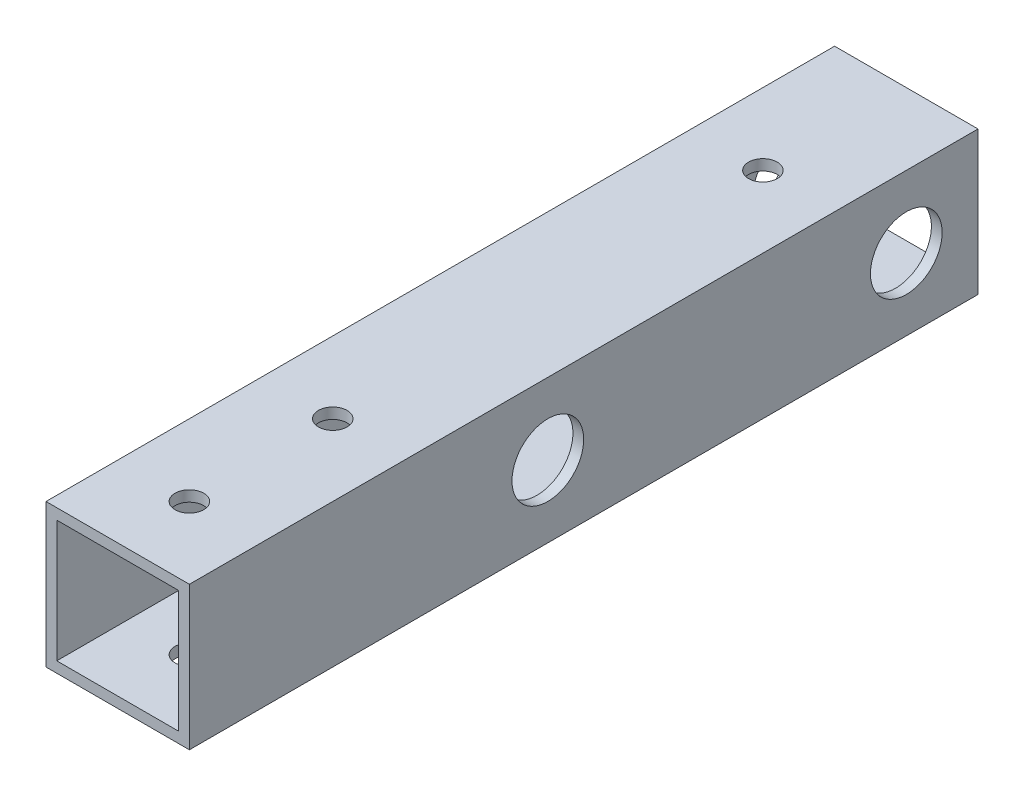
ISO-10303-21;
HEADER;
FILE_DESCRIPTION(('STEP AP214'),'2;1');
FILE_NAME('part.step','',(''),(''),'','','');
FILE_SCHEMA(('AUTOMOTIVE_DESIGN { 1 0 10303 214 1 1 1 1 }'));
ENDSEC;
DATA;
#1=APPLICATION_CONTEXT('core data for automotive mechanical design processes');
#2=APPLICATION_PROTOCOL_DEFINITION('international standard','automotive_design',2000,#1);
#3=PRODUCT_CONTEXT('',#1,'mechanical');
#4=PRODUCT('Part','Part','',(#3));
#5=PRODUCT_RELATED_PRODUCT_CATEGORY('part','',(#4));
#6=PRODUCT_DEFINITION_FORMATION('','',#4);
#7=PRODUCT_DEFINITION_CONTEXT('part definition',#1,'design');
#8=PRODUCT_DEFINITION('design','',#6,#7);
#9=PRODUCT_DEFINITION_SHAPE('','',#8);
#10=(LENGTH_UNIT() NAMED_UNIT(*) SI_UNIT(.MILLI.,.METRE.));
#11=(NAMED_UNIT(*) PLANE_ANGLE_UNIT() SI_UNIT($,.RADIAN.));
#12=(NAMED_UNIT(*) SI_UNIT($,.STERADIAN.) SOLID_ANGLE_UNIT());
#13=UNCERTAINTY_MEASURE_WITH_UNIT(LENGTH_MEASURE(1.E-05),#10,'distance_accuracy_value','');
#14=(GEOMETRIC_REPRESENTATION_CONTEXT(3) GLOBAL_UNCERTAINTY_ASSIGNED_CONTEXT((#13)) GLOBAL_UNIT_ASSIGNED_CONTEXT((#10,
#11,#12)) REPRESENTATION_CONTEXT('',''));
#15=CARTESIAN_POINT('',(0.,0.,0.));
#16=DIRECTION('',(0.,0.,1.));
#17=DIRECTION('',(1.,0.,0.));
#18=AXIS2_PLACEMENT_3D('',#15,#16,#17);
#19=CARTESIAN_POINT('',(0.,0.,110.));
#20=DIRECTION('',(0.,0.,-1.));
#21=DIRECTION('',(-1.,0.,0.));
#22=AXIS2_PLACEMENT_3D('',#19,#20,#21);
#23=PLANE('',#22);
#24=DIRECTION('',(0.,1.,0.));
#25=VECTOR('',#24,1.);
#26=CARTESIAN_POINT('',(10.,-10.,110.));
#27=LINE('',#26,#25);
#28=CARTESIAN_POINT('',(10.,-10.,110.));
#29=VERTEX_POINT('',#28);
#30=CARTESIAN_POINT('',(10.,10.,110.));
#31=VERTEX_POINT('',#30);
#32=EDGE_CURVE('E146',#29,#31,#27,.T.);
#33=ORIENTED_EDGE('',*,*,#32,.T.);
#34=DIRECTION('',(-1.,0.,0.));
#35=VECTOR('',#34,1.);
#36=CARTESIAN_POINT('',(-10.,10.,110.));
#37=LINE('',#36,#35);
#38=CARTESIAN_POINT('',(-10.,10.,110.));
#39=VERTEX_POINT('',#38);
#40=EDGE_CURVE('E149',#31,#39,#37,.T.);
#41=ORIENTED_EDGE('',*,*,#40,.T.);
#42=DIRECTION('',(0.,-1.,0.));
#43=VECTOR('',#42,1.);
#44=CARTESIAN_POINT('',(-10.,-10.,110.));
#45=LINE('',#44,#43);
#46=CARTESIAN_POINT('',(-10.,-10.,110.));
#47=VERTEX_POINT('',#46);
#48=EDGE_CURVE('E152',#39,#47,#45,.T.);
#49=ORIENTED_EDGE('',*,*,#48,.T.);
#50=DIRECTION('',(1.,0.,0.));
#51=VECTOR('',#50,1.);
#52=CARTESIAN_POINT('',(-10.,-10.,110.));
#53=LINE('',#52,#51);
#54=EDGE_CURVE('E154',#47,#29,#53,.T.);
#55=ORIENTED_EDGE('',*,*,#54,.T.);
#56=EDGE_LOOP('',(#33,#41,#49,#55));
#57=FACE_BOUND('',#56,.T.);
#58=DIRECTION('',(0.,1.,0.));
#59=VECTOR('',#58,1.);
#60=CARTESIAN_POINT('',(8.5,-8.5,110.));
#61=LINE('',#60,#59);
#62=CARTESIAN_POINT('',(8.5,-8.5,110.));
#63=VERTEX_POINT('',#62);
#64=CARTESIAN_POINT('',(8.5,8.5,110.));
#65=VERTEX_POINT('',#64);
#66=EDGE_CURVE('E108',#63,#65,#61,.T.);
#67=ORIENTED_EDGE('',*,*,#66,.F.);
#68=DIRECTION('',(1.,0.,0.));
#69=VECTOR('',#68,1.);
#70=CARTESIAN_POINT('',(-8.5,-8.5,110.));
#71=LINE('',#70,#69);
#72=CARTESIAN_POINT('',(-8.5,-8.5,110.));
#73=VERTEX_POINT('',#72);
#74=EDGE_CURVE('E130',#73,#63,#71,.T.);
#75=ORIENTED_EDGE('',*,*,#74,.F.);
#76=DIRECTION('',(0.,-1.,0.));
#77=VECTOR('',#76,1.);
#78=CARTESIAN_POINT('',(-8.5,-8.5,110.));
#79=LINE('',#78,#77);
#80=CARTESIAN_POINT('',(-8.5,8.5,110.));
#81=VERTEX_POINT('',#80);
#82=EDGE_CURVE('E128',#81,#73,#79,.T.);
#83=ORIENTED_EDGE('',*,*,#82,.F.);
#84=DIRECTION('',(-1.,0.,0.));
#85=VECTOR('',#84,1.);
#86=CARTESIAN_POINT('',(-8.5,8.5,110.));
#87=LINE('',#86,#85);
#88=EDGE_CURVE('E116',#65,#81,#87,.T.);
#89=ORIENTED_EDGE('',*,*,#88,.F.);
#90=EDGE_LOOP('',(#67,#75,#83,#89));
#91=FACE_BOUND('',#90,.T.);
#92=ADVANCED_FACE('F41',(#57,#91),#23,.F.);
#93=CARTESIAN_POINT('',(0.,0.,0.));
#94=DIRECTION('',(0.,0.,-1.));
#95=DIRECTION('',(-1.,0.,0.));
#96=AXIS2_PLACEMENT_3D('',#93,#94,#95);
#97=PLANE('',#96);
#98=DIRECTION('',(0.,1.,0.));
#99=VECTOR('',#98,1.);
#100=CARTESIAN_POINT('',(10.,-10.,0.));
#101=LINE('',#100,#99);
#102=CARTESIAN_POINT('',(10.,-10.,0.));
#103=VERTEX_POINT('',#102);
#104=CARTESIAN_POINT('',(10.,10.,0.));
#105=VERTEX_POINT('',#104);
#106=EDGE_CURVE('E124',#103,#105,#101,.T.);
#107=ORIENTED_EDGE('',*,*,#106,.F.);
#108=DIRECTION('',(1.,0.,0.));
#109=VECTOR('',#108,1.);
#110=CARTESIAN_POINT('',(-10.,-10.,0.));
#111=LINE('',#110,#109);
#112=CARTESIAN_POINT('',(-10.,-10.,0.));
#113=VERTEX_POINT('',#112);
#114=EDGE_CURVE('E150',#113,#103,#111,.T.);
#115=ORIENTED_EDGE('',*,*,#114,.F.);
#116=DIRECTION('',(0.,-1.,0.));
#117=VECTOR('',#116,1.);
#118=CARTESIAN_POINT('',(-10.,-10.,0.));
#119=LINE('',#118,#117);
#120=CARTESIAN_POINT('',(-10.,10.,0.));
#121=VERTEX_POINT('',#120);
#122=EDGE_CURVE('E161',#121,#113,#119,.T.);
#123=ORIENTED_EDGE('',*,*,#122,.F.);
#124=DIRECTION('',(-1.,0.,0.));
#125=VECTOR('',#124,1.);
#126=CARTESIAN_POINT('',(-10.,10.,0.));
#127=LINE('',#126,#125);
#128=EDGE_CURVE('E159',#105,#121,#127,.T.);
#129=ORIENTED_EDGE('',*,*,#128,.F.);
#130=EDGE_LOOP('',(#107,#115,#123,#129));
#131=FACE_BOUND('',#130,.T.);
#132=DIRECTION('',(1.,0.,0.));
#133=VECTOR('',#132,1.);
#134=CARTESIAN_POINT('',(-8.5,-8.5,0.));
#135=LINE('',#134,#133);
#136=CARTESIAN_POINT('',(-8.5,-8.5,0.));
#137=VERTEX_POINT('',#136);
#138=CARTESIAN_POINT('',(8.5,-8.5,0.));
#139=VERTEX_POINT('',#138);
#140=EDGE_CURVE('E117',#137,#139,#135,.T.);
#141=ORIENTED_EDGE('',*,*,#140,.T.);
#142=DIRECTION('',(0.,1.,0.));
#143=VECTOR('',#142,1.);
#144=CARTESIAN_POINT('',(8.5,-8.5,0.));
#145=LINE('',#144,#143);
#146=CARTESIAN_POINT('',(8.5,8.5,0.));
#147=VERTEX_POINT('',#146);
#148=EDGE_CURVE('E66',#139,#147,#145,.T.);
#149=ORIENTED_EDGE('',*,*,#148,.T.);
#150=DIRECTION('',(-1.,0.,0.));
#151=VECTOR('',#150,1.);
#152=CARTESIAN_POINT('',(-8.5,8.5,0.));
#153=LINE('',#152,#151);
#154=CARTESIAN_POINT('',(-8.5,8.5,0.));
#155=VERTEX_POINT('',#154);
#156=EDGE_CURVE('E123',#147,#155,#153,.T.);
#157=ORIENTED_EDGE('',*,*,#156,.T.);
#158=DIRECTION('',(0.,-1.,0.));
#159=VECTOR('',#158,1.);
#160=CARTESIAN_POINT('',(-8.5,-8.5,0.));
#161=LINE('',#160,#159);
#162=EDGE_CURVE('E138',#155,#137,#161,.T.);
#163=ORIENTED_EDGE('',*,*,#162,.T.);
#164=EDGE_LOOP('',(#141,#149,#157,#163));
#165=FACE_BOUND('',#164,.T.);
#166=ADVANCED_FACE('F254',(#131,#165),#97,.T.);
#167=CARTESIAN_POINT('',(10.,-10.,110.));
#168=DIRECTION('',(-1.,0.,0.));
#169=DIRECTION('',(0.,0.,1.));
#170=AXIS2_PLACEMENT_3D('',#167,#168,#169);
#171=PLANE('',#170);
#172=CARTESIAN_POINT('',(10.,0.,10.));
#173=DIRECTION('',(-1.,0.,0.));
#174=DIRECTION('',(0.,0.,1.));
#175=AXIS2_PLACEMENT_3D('',#172,#173,#174);
#176=CIRCLE('',#175,5.);
#177=CARTESIAN_POINT('',(10.,0.,15.));
#178=VERTEX_POINT('',#177);
#179=EDGE_CURVE('E193',#178,#178,#176,.T.);
#180=ORIENTED_EDGE('',*,*,#179,.T.);
#181=EDGE_LOOP('',(#180));
#182=FACE_BOUND('',#181,.T.);
#183=CARTESIAN_POINT('',(10.,0.,60.));
#184=DIRECTION('',(-1.,0.,0.));
#185=DIRECTION('',(0.,0.,1.));
#186=AXIS2_PLACEMENT_3D('',#183,#184,#185);
#187=CIRCLE('',#186,5.);
#188=CARTESIAN_POINT('',(10.,0.,65.));
#189=VERTEX_POINT('',#188);
#190=EDGE_CURVE('E198',#189,#189,#187,.T.);
#191=ORIENTED_EDGE('',*,*,#190,.T.);
#192=EDGE_LOOP('',(#191));
#193=FACE_BOUND('',#192,.T.);
#194=ORIENTED_EDGE('',*,*,#106,.T.);
#195=DIRECTION('',(0.,0.,-1.));
#196=VECTOR('',#195,1.);
#197=CARTESIAN_POINT('',(10.,10.,110.));
#198=LINE('',#197,#196);
#199=EDGE_CURVE('E11',#31,#105,#198,.T.);
#200=ORIENTED_EDGE('',*,*,#199,.F.);
#201=ORIENTED_EDGE('',*,*,#32,.F.);
#202=DIRECTION('',(0.,0.,-1.));
#203=VECTOR('',#202,1.);
#204=CARTESIAN_POINT('',(10.,-10.,110.));
#205=LINE('',#204,#203);
#206=EDGE_CURVE('E156',#29,#103,#205,.T.);
#207=ORIENTED_EDGE('',*,*,#206,.T.);
#208=EDGE_LOOP('',(#194,#200,#201,#207));
#209=FACE_BOUND('',#208,.T.);
#210=ADVANCED_FACE('F43',(#182,#193,#209),#171,.F.);
#211=CARTESIAN_POINT('',(-10.,10.,110.));
#212=DIRECTION('',(0.,-1.,0.));
#213=DIRECTION('',(0.,0.,-1.));
#214=AXIS2_PLACEMENT_3D('',#211,#212,#213);
#215=PLANE('',#214);
#216=CARTESIAN_POINT('',(0.,10.,100.));
#217=DIRECTION('',(0.,1.,0.));
#218=DIRECTION('',(0.,0.,1.));
#219=AXIS2_PLACEMENT_3D('',#216,#217,#218);
#220=CIRCLE('',#219,2.);
#221=CARTESIAN_POINT('',(0.,10.,102.));
#222=VERTEX_POINT('',#221);
#223=EDGE_CURVE('E210',#222,#222,#220,.T.);
#224=ORIENTED_EDGE('',*,*,#223,.F.);
#225=EDGE_LOOP('',(#224));
#226=FACE_BOUND('',#225,.T.);
#227=CARTESIAN_POINT('',(0.,10.,80.));
#228=DIRECTION('',(0.,1.,0.));
#229=DIRECTION('',(0.,0.,1.));
#230=AXIS2_PLACEMENT_3D('',#227,#228,#229);
#231=CIRCLE('',#230,2.);
#232=CARTESIAN_POINT('',(0.,10.,82.));
#233=VERTEX_POINT('',#232);
#234=EDGE_CURVE('E213',#233,#233,#231,.T.);
#235=ORIENTED_EDGE('',*,*,#234,.F.);
#236=EDGE_LOOP('',(#235));
#237=FACE_BOUND('',#236,.T.);
#238=CARTESIAN_POINT('',(-2.06718869533235E-13,10.,20.));
#239=DIRECTION('',(0.,1.,0.));
#240=DIRECTION('',(0.,0.,1.));
#241=AXIS2_PLACEMENT_3D('',#238,#239,#240);
#242=CIRCLE('',#241,2.);
#243=CARTESIAN_POINT('',(-2.06718869533235E-13,10.,22.));
#244=VERTEX_POINT('',#243);
#245=EDGE_CURVE('E189',#244,#244,#242,.T.);
#246=ORIENTED_EDGE('',*,*,#245,.F.);
#247=EDGE_LOOP('',(#246));
#248=FACE_BOUND('',#247,.T.);
#249=ORIENTED_EDGE('',*,*,#128,.T.);
#250=DIRECTION('',(0.,0.,-1.));
#251=VECTOR('',#250,1.);
#252=CARTESIAN_POINT('',(-10.,10.,110.));
#253=LINE('',#252,#251);
#254=EDGE_CURVE('E50',#39,#121,#253,.T.);
#255=ORIENTED_EDGE('',*,*,#254,.F.);
#256=ORIENTED_EDGE('',*,*,#40,.F.);
#257=ORIENTED_EDGE('',*,*,#199,.T.);
#258=EDGE_LOOP('',(#249,#255,#256,#257));
#259=FACE_BOUND('',#258,.T.);
#260=ADVANCED_FACE('F270',(#226,#237,#248,#259),#215,.F.);
#261=CARTESIAN_POINT('',(-10.,-10.,110.));
#262=DIRECTION('',(1.,0.,0.));
#263=DIRECTION('',(0.,0.,-1.));
#264=AXIS2_PLACEMENT_3D('',#261,#262,#263);
#265=PLANE('',#264);
#266=CARTESIAN_POINT('',(-10.,0.,10.));
#267=DIRECTION('',(1.,0.,0.));
#268=DIRECTION('',(0.,0.,-1.));
#269=AXIS2_PLACEMENT_3D('',#266,#267,#268);
#270=CIRCLE('',#269,2.7);
#271=CARTESIAN_POINT('',(-10.,0.,7.3));
#272=VERTEX_POINT('',#271);
#273=EDGE_CURVE('E136',#272,#272,#270,.T.);
#274=ORIENTED_EDGE('',*,*,#273,.T.);
#275=EDGE_LOOP('',(#274));
#276=FACE_BOUND('',#275,.T.);
#277=CARTESIAN_POINT('',(-10.,0.,60.));
#278=DIRECTION('',(1.,0.,0.));
#279=DIRECTION('',(0.,0.,-1.));
#280=AXIS2_PLACEMENT_3D('',#277,#278,#279);
#281=CIRCLE('',#280,2.7);
#282=CARTESIAN_POINT('',(-10.,0.,57.3));
#283=VERTEX_POINT('',#282);
#284=EDGE_CURVE('E174',#283,#283,#281,.T.);
#285=ORIENTED_EDGE('',*,*,#284,.T.);
#286=EDGE_LOOP('',(#285));
#287=FACE_BOUND('',#286,.T.);
#288=ORIENTED_EDGE('',*,*,#122,.T.);
#289=DIRECTION('',(0.,0.,-1.));
#290=VECTOR('',#289,1.);
#291=CARTESIAN_POINT('',(-10.,-10.,110.));
#292=LINE('',#291,#290);
#293=EDGE_CURVE('E166',#47,#113,#292,.T.);
#294=ORIENTED_EDGE('',*,*,#293,.F.);
#295=ORIENTED_EDGE('',*,*,#48,.F.);
#296=ORIENTED_EDGE('',*,*,#254,.T.);
#297=EDGE_LOOP('',(#288,#294,#295,#296));
#298=FACE_BOUND('',#297,.T.);
#299=ADVANCED_FACE('F231',(#276,#287,#298),#265,.F.);
#300=CARTESIAN_POINT('',(-10.,-10.,110.));
#301=DIRECTION('',(0.,1.,0.));
#302=DIRECTION('',(0.,0.,1.));
#303=AXIS2_PLACEMENT_3D('',#300,#301,#302);
#304=PLANE('',#303);
#305=CARTESIAN_POINT('',(-5.38458166943201E-12,-10.,20.0000000000006));
#306=DIRECTION('',(0.,-1.,0.));
#307=DIRECTION('',(0.,0.,-1.));
#308=AXIS2_PLACEMENT_3D('',#305,#306,#307);
#309=CIRCLE('',#308,5.);
#310=CARTESIAN_POINT('',(-5.38458166943201E-12,-10.,15.0000000000006));
#311=VERTEX_POINT('',#310);
#312=EDGE_CURVE('E190',#311,#311,#309,.T.);
#313=ORIENTED_EDGE('',*,*,#312,.F.);
#314=EDGE_LOOP('',(#313));
#315=FACE_BOUND('',#314,.T.);
#316=CARTESIAN_POINT('',(0.,-10.,100.));
#317=DIRECTION('',(0.,1.,0.));
#318=DIRECTION('',(0.,0.,1.));
#319=AXIS2_PLACEMENT_3D('',#316,#317,#318);
#320=CIRCLE('',#319,2.);
#321=CARTESIAN_POINT('',(0.,-10.,102.));
#322=VERTEX_POINT('',#321);
#323=EDGE_CURVE('E207',#322,#322,#320,.T.);
#324=ORIENTED_EDGE('',*,*,#323,.T.);
#325=EDGE_LOOP('',(#324));
#326=FACE_BOUND('',#325,.T.);
#327=CARTESIAN_POINT('',(0.,-10.,80.));
#328=DIRECTION('',(0.,1.,0.));
#329=DIRECTION('',(0.,0.,1.));
#330=AXIS2_PLACEMENT_3D('',#327,#328,#329);
#331=CIRCLE('',#330,2.);
#332=CARTESIAN_POINT('',(0.,-10.,82.));
#333=VERTEX_POINT('',#332);
#334=EDGE_CURVE('E216',#333,#333,#331,.T.);
#335=ORIENTED_EDGE('',*,*,#334,.T.);
#336=EDGE_LOOP('',(#335));
#337=FACE_BOUND('',#336,.T.);
#338=ORIENTED_EDGE('',*,*,#114,.T.);
#339=ORIENTED_EDGE('',*,*,#206,.F.);
#340=ORIENTED_EDGE('',*,*,#54,.F.);
#341=ORIENTED_EDGE('',*,*,#293,.T.);
#342=EDGE_LOOP('',(#338,#339,#340,#341));
#343=FACE_BOUND('',#342,.T.);
#344=ADVANCED_FACE('F265',(#315,#326,#337,#343),#304,.F.);
#345=CARTESIAN_POINT('',(8.5,-8.5,110.));
#346=DIRECTION('',(-1.,0.,0.));
#347=DIRECTION('',(0.,0.,1.));
#348=AXIS2_PLACEMENT_3D('',#345,#346,#347);
#349=PLANE('',#348);
#350=CARTESIAN_POINT('',(8.5,0.,10.));
#351=DIRECTION('',(-1.,0.,0.));
#352=DIRECTION('',(0.,0.,1.));
#353=AXIS2_PLACEMENT_3D('',#350,#351,#352);
#354=CIRCLE('',#353,5.);
#355=CARTESIAN_POINT('',(8.5,0.,15.));
#356=VERTEX_POINT('',#355);
#357=EDGE_CURVE('E45',#356,#356,#354,.T.);
#358=ORIENTED_EDGE('',*,*,#357,.F.);
#359=EDGE_LOOP('',(#358));
#360=FACE_BOUND('',#359,.T.);
#361=CARTESIAN_POINT('',(8.5,0.,60.));
#362=DIRECTION('',(-1.,0.,0.));
#363=DIRECTION('',(0.,0.,1.));
#364=AXIS2_PLACEMENT_3D('',#361,#362,#363);
#365=CIRCLE('',#364,5.);
#366=CARTESIAN_POINT('',(8.5,0.,65.));
#367=VERTEX_POINT('',#366);
#368=EDGE_CURVE('E191',#367,#367,#365,.T.);
#369=ORIENTED_EDGE('',*,*,#368,.F.);
#370=EDGE_LOOP('',(#369));
#371=FACE_BOUND('',#370,.T.);
#372=ORIENTED_EDGE('',*,*,#148,.F.);
#373=DIRECTION('',(0.,0.,-1.));
#374=VECTOR('',#373,1.);
#375=CARTESIAN_POINT('',(8.5,-8.5,110.));
#376=LINE('',#375,#374);
#377=EDGE_CURVE('E112',#63,#139,#376,.T.);
#378=ORIENTED_EDGE('',*,*,#377,.F.);
#379=ORIENTED_EDGE('',*,*,#66,.T.);
#380=DIRECTION('',(0.,0.,-1.));
#381=VECTOR('',#380,1.);
#382=CARTESIAN_POINT('',(8.5,8.5,110.));
#383=LINE('',#382,#381);
#384=EDGE_CURVE('E111',#65,#147,#383,.T.);
#385=ORIENTED_EDGE('',*,*,#384,.T.);
#386=EDGE_LOOP('',(#372,#378,#379,#385));
#387=FACE_BOUND('',#386,.T.);
#388=ADVANCED_FACE('F110',(#360,#371,#387),#349,.T.);
#389=CARTESIAN_POINT('',(-8.5,8.5,110.));
#390=DIRECTION('',(0.,-1.,0.));
#391=DIRECTION('',(0.,0.,-1.));
#392=AXIS2_PLACEMENT_3D('',#389,#390,#391);
#393=PLANE('',#392);
#394=CARTESIAN_POINT('',(0.,8.5,100.));
#395=DIRECTION('',(0.,-1.,0.));
#396=DIRECTION('',(0.,0.,-1.));
#397=AXIS2_PLACEMENT_3D('',#394,#395,#396);
#398=CIRCLE('',#397,2.);
#399=CARTESIAN_POINT('',(0.,8.5,98.));
#400=VERTEX_POINT('',#399);
#401=EDGE_CURVE('E175',#400,#400,#398,.T.);
#402=ORIENTED_EDGE('',*,*,#401,.F.);
#403=EDGE_LOOP('',(#402));
#404=FACE_BOUND('',#403,.T.);
#405=CARTESIAN_POINT('',(0.,8.5,80.));
#406=DIRECTION('',(0.,-1.,0.));
#407=DIRECTION('',(0.,0.,-1.));
#408=AXIS2_PLACEMENT_3D('',#405,#406,#407);
#409=CIRCLE('',#408,2.);
#410=CARTESIAN_POINT('',(0.,8.5,78.));
#411=VERTEX_POINT('',#410);
#412=EDGE_CURVE('E182',#411,#411,#409,.T.);
#413=ORIENTED_EDGE('',*,*,#412,.F.);
#414=EDGE_LOOP('',(#413));
#415=FACE_BOUND('',#414,.T.);
#416=CARTESIAN_POINT('',(-2.06718869533235E-13,8.5,20.));
#417=DIRECTION('',(0.,-1.,0.));
#418=DIRECTION('',(0.,0.,-1.));
#419=AXIS2_PLACEMENT_3D('',#416,#417,#418);
#420=CIRCLE('',#419,2.);
#421=CARTESIAN_POINT('',(-2.06718869533235E-13,8.5,18.));
#422=VERTEX_POINT('',#421);
#423=EDGE_CURVE('E183',#422,#422,#420,.T.);
#424=ORIENTED_EDGE('',*,*,#423,.F.);
#425=EDGE_LOOP('',(#424));
#426=FACE_BOUND('',#425,.T.);
#427=ORIENTED_EDGE('',*,*,#156,.F.);
#428=ORIENTED_EDGE('',*,*,#384,.F.);
#429=ORIENTED_EDGE('',*,*,#88,.T.);
#430=DIRECTION('',(0.,0.,-1.));
#431=VECTOR('',#430,1.);
#432=CARTESIAN_POINT('',(-8.5,8.5,110.));
#433=LINE('',#432,#431);
#434=EDGE_CURVE('E125',#81,#155,#433,.T.);
#435=ORIENTED_EDGE('',*,*,#434,.T.);
#436=EDGE_LOOP('',(#427,#428,#429,#435));
#437=FACE_BOUND('',#436,.T.);
#438=ADVANCED_FACE('F120',(#404,#415,#426,#437),#393,.T.);
#439=CARTESIAN_POINT('',(-8.5,-8.5,110.));
#440=DIRECTION('',(1.,0.,0.));
#441=DIRECTION('',(0.,0.,-1.));
#442=AXIS2_PLACEMENT_3D('',#439,#440,#441);
#443=PLANE('',#442);
#444=CARTESIAN_POINT('',(-8.5,0.,10.));
#445=DIRECTION('',(1.,0.,0.));
#446=DIRECTION('',(0.,0.,-1.));
#447=AXIS2_PLACEMENT_3D('',#444,#445,#446);
#448=CIRCLE('',#447,2.7);
#449=CARTESIAN_POINT('',(-8.5,0.,7.3));
#450=VERTEX_POINT('',#449);
#451=EDGE_CURVE('E176',#450,#450,#448,.T.);
#452=ORIENTED_EDGE('',*,*,#451,.F.);
#453=EDGE_LOOP('',(#452));
#454=FACE_BOUND('',#453,.T.);
#455=CARTESIAN_POINT('',(-8.5,0.,60.));
#456=DIRECTION('',(1.,0.,0.));
#457=DIRECTION('',(0.,0.,-1.));
#458=AXIS2_PLACEMENT_3D('',#455,#456,#457);
#459=CIRCLE('',#458,2.7);
#460=CARTESIAN_POINT('',(-8.5,0.,57.3));
#461=VERTEX_POINT('',#460);
#462=EDGE_CURVE('E171',#461,#461,#459,.T.);
#463=ORIENTED_EDGE('',*,*,#462,.F.);
#464=EDGE_LOOP('',(#463));
#465=FACE_BOUND('',#464,.T.);
#466=ORIENTED_EDGE('',*,*,#162,.F.);
#467=ORIENTED_EDGE('',*,*,#434,.F.);
#468=ORIENTED_EDGE('',*,*,#82,.T.);
#469=DIRECTION('',(0.,0.,-1.));
#470=VECTOR('',#469,1.);
#471=CARTESIAN_POINT('',(-8.5,-8.5,110.));
#472=LINE('',#471,#470);
#473=EDGE_CURVE('E58',#73,#137,#472,.T.);
#474=ORIENTED_EDGE('',*,*,#473,.T.);
#475=EDGE_LOOP('',(#466,#467,#468,#474));
#476=FACE_BOUND('',#475,.T.);
#477=ADVANCED_FACE('F298',(#454,#465,#476),#443,.T.);
#478=CARTESIAN_POINT('',(-8.5,-8.5,110.));
#479=DIRECTION('',(0.,1.,0.));
#480=DIRECTION('',(0.,0.,1.));
#481=AXIS2_PLACEMENT_3D('',#478,#479,#480);
#482=PLANE('',#481);
#483=CARTESIAN_POINT('',(-5.38458166943201E-12,-8.5,20.0000000000006));
#484=DIRECTION('',(0.,1.,0.));
#485=DIRECTION('',(0.,0.,1.));
#486=AXIS2_PLACEMENT_3D('',#483,#484,#485);
#487=CIRCLE('',#486,5.);
#488=CARTESIAN_POINT('',(-5.38458166943201E-12,-8.5,25.0000000000006));
#489=VERTEX_POINT('',#488);
#490=EDGE_CURVE('E187',#489,#489,#487,.T.);
#491=ORIENTED_EDGE('',*,*,#490,.F.);
#492=EDGE_LOOP('',(#491));
#493=FACE_BOUND('',#492,.T.);
#494=CARTESIAN_POINT('',(0.,-8.5,100.));
#495=DIRECTION('',(0.,1.,0.));
#496=DIRECTION('',(0.,0.,1.));
#497=AXIS2_PLACEMENT_3D('',#494,#495,#496);
#498=CIRCLE('',#497,2.);
#499=CARTESIAN_POINT('',(0.,-8.5,102.));
#500=VERTEX_POINT('',#499);
#501=EDGE_CURVE('E184',#500,#500,#498,.T.);
#502=ORIENTED_EDGE('',*,*,#501,.F.);
#503=EDGE_LOOP('',(#502));
#504=FACE_BOUND('',#503,.T.);
#505=CARTESIAN_POINT('',(0.,-8.5,80.));
#506=DIRECTION('',(0.,1.,0.));
#507=DIRECTION('',(0.,0.,1.));
#508=AXIS2_PLACEMENT_3D('',#505,#506,#507);
#509=CIRCLE('',#508,2.);
#510=CARTESIAN_POINT('',(0.,-8.5,82.));
#511=VERTEX_POINT('',#510);
#512=EDGE_CURVE('E179',#511,#511,#509,.T.);
#513=ORIENTED_EDGE('',*,*,#512,.F.);
#514=EDGE_LOOP('',(#513));
#515=FACE_BOUND('',#514,.T.);
#516=ORIENTED_EDGE('',*,*,#140,.F.);
#517=ORIENTED_EDGE('',*,*,#473,.F.);
#518=ORIENTED_EDGE('',*,*,#74,.T.);
#519=ORIENTED_EDGE('',*,*,#377,.T.);
#520=EDGE_LOOP('',(#516,#517,#518,#519));
#521=FACE_BOUND('',#520,.T.);
#522=ADVANCED_FACE('F249',(#493,#504,#515,#521),#482,.T.);
#523=CARTESIAN_POINT('',(-15.,0.,60.));
#524=DIRECTION('',(1.,0.,0.));
#525=DIRECTION('',(0.,0.,-1.));
#526=AXIS2_PLACEMENT_3D('',#523,#524,#525);
#527=CYLINDRICAL_SURFACE('',#526,2.7);
#528=ORIENTED_EDGE('',*,*,#462,.T.);
#529=EDGE_LOOP('',(#528));
#530=FACE_BOUND('',#529,.T.);
#531=ORIENTED_EDGE('',*,*,#284,.F.);
#532=EDGE_LOOP('',(#531));
#533=FACE_BOUND('',#532,.T.);
#534=ADVANCED_FACE('F237',(#530,#533),#527,.F.);
#535=CARTESIAN_POINT('',(-15.,0.,10.));
#536=DIRECTION('',(1.,0.,0.));
#537=DIRECTION('',(0.,0.,-1.));
#538=AXIS2_PLACEMENT_3D('',#535,#536,#537);
#539=CYLINDRICAL_SURFACE('',#538,2.7);
#540=ORIENTED_EDGE('',*,*,#451,.T.);
#541=EDGE_LOOP('',(#540));
#542=FACE_BOUND('',#541,.T.);
#543=ORIENTED_EDGE('',*,*,#273,.F.);
#544=EDGE_LOOP('',(#543));
#545=FACE_BOUND('',#544,.T.);
#546=ADVANCED_FACE('F234',(#542,#545),#539,.F.);
#547=CARTESIAN_POINT('',(0.,-10.,80.));
#548=DIRECTION('',(0.,1.,0.));
#549=DIRECTION('',(0.,0.,1.));
#550=AXIS2_PLACEMENT_3D('',#547,#548,#549);
#551=CYLINDRICAL_SURFACE('',#550,2.);
#552=ORIENTED_EDGE('',*,*,#512,.T.);
#553=EDGE_LOOP('',(#552));
#554=FACE_BOUND('',#553,.T.);
#555=ORIENTED_EDGE('',*,*,#334,.F.);
#556=EDGE_LOOP('',(#555));
#557=FACE_BOUND('',#556,.T.);
#558=ADVANCED_FACE('F236',(#554,#557),#551,.F.);
#559=CARTESIAN_POINT('',(0.,-10.,100.));
#560=DIRECTION('',(0.,1.,0.));
#561=DIRECTION('',(0.,0.,1.));
#562=AXIS2_PLACEMENT_3D('',#559,#560,#561);
#563=CYLINDRICAL_SURFACE('',#562,2.);
#564=ORIENTED_EDGE('',*,*,#501,.T.);
#565=EDGE_LOOP('',(#564));
#566=FACE_BOUND('',#565,.T.);
#567=ORIENTED_EDGE('',*,*,#323,.F.);
#568=EDGE_LOOP('',(#567));
#569=FACE_BOUND('',#568,.T.);
#570=ADVANCED_FACE('F245',(#566,#569),#563,.F.);
#571=CARTESIAN_POINT('',(-2.06718869533235E-13,-10.,20.));
#572=DIRECTION('',(0.,1.,0.));
#573=DIRECTION('',(0.,0.,1.));
#574=AXIS2_PLACEMENT_3D('',#571,#572,#573);
#575=CYLINDRICAL_SURFACE('',#574,2.);
#576=ORIENTED_EDGE('',*,*,#423,.T.);
#577=EDGE_LOOP('',(#576));
#578=FACE_BOUND('',#577,.T.);
#579=ORIENTED_EDGE('',*,*,#245,.T.);
#580=EDGE_LOOP('',(#579));
#581=FACE_BOUND('',#580,.T.);
#582=ADVANCED_FACE('F320',(#578,#581),#575,.F.);
#583=ORIENTED_EDGE('',*,*,#412,.T.);
#584=EDGE_LOOP('',(#583));
#585=FACE_BOUND('',#584,.T.);
#586=ORIENTED_EDGE('',*,*,#234,.T.);
#587=EDGE_LOOP('',(#586));
#588=FACE_BOUND('',#587,.T.);
#589=ADVANCED_FACE('F248',(#585,#588),#551,.F.);
#590=ORIENTED_EDGE('',*,*,#401,.T.);
#591=EDGE_LOOP('',(#590));
#592=FACE_BOUND('',#591,.T.);
#593=ORIENTED_EDGE('',*,*,#223,.T.);
#594=EDGE_LOOP('',(#593));
#595=FACE_BOUND('',#594,.T.);
#596=ADVANCED_FACE('F327',(#592,#595),#563,.F.);
#597=CARTESIAN_POINT('',(-5.38458166943201E-12,0.,20.0000000000006));
#598=DIRECTION('',(0.,-1.,0.));
#599=DIRECTION('',(0.,0.,-1.));
#600=AXIS2_PLACEMENT_3D('',#597,#598,#599);
#601=CYLINDRICAL_SURFACE('',#600,5.);
#602=ORIENTED_EDGE('',*,*,#490,.T.);
#603=EDGE_LOOP('',(#602));
#604=FACE_BOUND('',#603,.T.);
#605=ORIENTED_EDGE('',*,*,#312,.T.);
#606=EDGE_LOOP('',(#605));
#607=FACE_BOUND('',#606,.T.);
#608=ADVANCED_FACE('F332',(#604,#607),#601,.F.);
#609=CARTESIAN_POINT('',(10.,0.,60.));
#610=DIRECTION('',(-1.,0.,0.));
#611=DIRECTION('',(0.,0.,1.));
#612=AXIS2_PLACEMENT_3D('',#609,#610,#611);
#613=CYLINDRICAL_SURFACE('',#612,5.);
#614=ORIENTED_EDGE('',*,*,#368,.T.);
#615=EDGE_LOOP('',(#614));
#616=FACE_BOUND('',#615,.T.);
#617=ORIENTED_EDGE('',*,*,#190,.F.);
#618=EDGE_LOOP('',(#617));
#619=FACE_BOUND('',#618,.T.);
#620=ADVANCED_FACE('F334',(#616,#619),#613,.F.);
#621=CARTESIAN_POINT('',(10.,0.,10.));
#622=DIRECTION('',(-1.,0.,0.));
#623=DIRECTION('',(0.,0.,1.));
#624=AXIS2_PLACEMENT_3D('',#621,#622,#623);
#625=CYLINDRICAL_SURFACE('',#624,5.);
#626=ORIENTED_EDGE('',*,*,#357,.T.);
#627=EDGE_LOOP('',(#626));
#628=FACE_BOUND('',#627,.T.);
#629=ORIENTED_EDGE('',*,*,#179,.F.);
#630=EDGE_LOOP('',(#629));
#631=FACE_BOUND('',#630,.T.);
#632=ADVANCED_FACE('F338',(#628,#631),#625,.F.);
#633=CLOSED_SHELL('',(#92,#166,#210,#260,#299,#344,#388,#438,#477,#522,#534,#546,#558,#570,#582,
#589,#596,#608,#620,#632));
#634=MANIFOLD_SOLID_BREP('B2',#633);
#635=ADVANCED_BREP_SHAPE_REPRESENTATION('',(#18,#634),#14);
#636=SHAPE_DEFINITION_REPRESENTATION(#9,#635);
ENDSEC;
END-ISO-10303-21;
